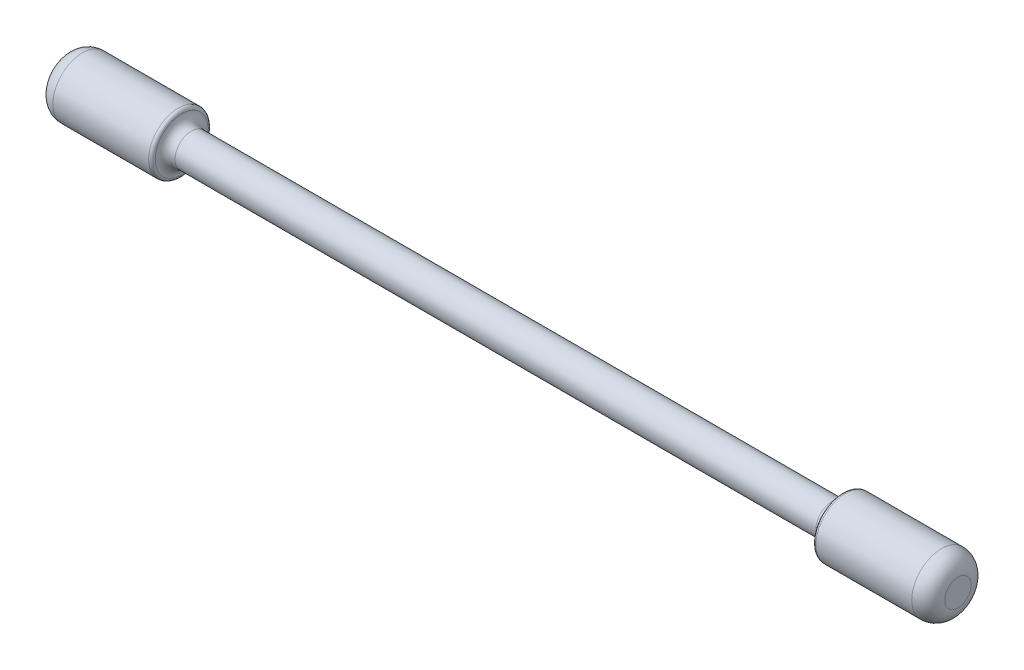
ISO-10303-21;
HEADER;
FILE_DESCRIPTION(('STEP AP214'),'2;1');
FILE_NAME('part.step','',(''),(''),'','','');
FILE_SCHEMA(('AUTOMOTIVE_DESIGN { 1 0 10303 214 1 1 1 1 }'));
ENDSEC;
DATA;
#1=APPLICATION_CONTEXT('core data for automotive mechanical design processes');
#2=APPLICATION_PROTOCOL_DEFINITION('international standard','automotive_design',2000,#1);
#3=PRODUCT_CONTEXT('',#1,'mechanical');
#4=PRODUCT('Part','Part','',(#3));
#5=PRODUCT_RELATED_PRODUCT_CATEGORY('part','',(#4));
#6=PRODUCT_DEFINITION_FORMATION('','',#4);
#7=PRODUCT_DEFINITION_CONTEXT('part definition',#1,'design');
#8=PRODUCT_DEFINITION('design','',#6,#7);
#9=PRODUCT_DEFINITION_SHAPE('','',#8);
#10=(LENGTH_UNIT() NAMED_UNIT(*) SI_UNIT(.MILLI.,.METRE.));
#11=(NAMED_UNIT(*) PLANE_ANGLE_UNIT() SI_UNIT($,.RADIAN.));
#12=(NAMED_UNIT(*) SI_UNIT($,.STERADIAN.) SOLID_ANGLE_UNIT());
#13=UNCERTAINTY_MEASURE_WITH_UNIT(LENGTH_MEASURE(1.E-05),#10,'distance_accuracy_value','');
#14=(GEOMETRIC_REPRESENTATION_CONTEXT(3) GLOBAL_UNCERTAINTY_ASSIGNED_CONTEXT((#13)) GLOBAL_UNIT_ASSIGNED_CONTEXT((#10,
#11,#12)) REPRESENTATION_CONTEXT('',''));
#15=CARTESIAN_POINT('',(0.,0.,0.));
#16=DIRECTION('',(0.,0.,1.));
#17=DIRECTION('',(1.,0.,0.));
#18=AXIS2_PLACEMENT_3D('',#15,#16,#17);
#19=CARTESIAN_POINT('',(-135.,0.,0.));
#20=DIRECTION('',(1.,0.,0.));
#21=DIRECTION('',(0.,0.,-1.));
#22=AXIS2_PLACEMENT_3D('',#19,#20,#21);
#23=PLANE('',#22);
#24=CARTESIAN_POINT('',(-135.,0.,0.));
#25=DIRECTION('',(1.,0.,0.));
#26=DIRECTION('',(0.,0.,-1.));
#27=AXIS2_PLACEMENT_3D('',#24,#25,#26);
#28=CIRCLE('',#27,4.00000000000003);
#29=CARTESIAN_POINT('',(-135.,0.,-4.00000000000003));
#30=VERTEX_POINT('',#29);
#31=EDGE_CURVE('E53',#30,#30,#28,.F.);
#32=ORIENTED_EDGE('',*,*,#31,.T.);
#33=EDGE_LOOP('',(#32));
#34=FACE_BOUND('',#33,.T.);
#35=ADVANCED_FACE('F40',(#34),#23,.F.);
#36=CARTESIAN_POINT('',(135.,0.,0.));
#37=DIRECTION('',(1.,0.,0.));
#38=DIRECTION('',(0.,0.,-1.));
#39=AXIS2_PLACEMENT_3D('',#36,#37,#38);
#40=CYLINDRICAL_SURFACE('',#39,9.00000000000003);
#41=CARTESIAN_POINT('',(-130.,0.,0.));
#42=DIRECTION('',(1.,0.,0.));
#43=DIRECTION('',(0.,0.,-1.));
#44=AXIS2_PLACEMENT_3D('',#41,#42,#43);
#45=CIRCLE('',#44,9.00000000000003);
#46=CARTESIAN_POINT('',(-130.,0.,-9.00000000000003));
#47=VERTEX_POINT('',#46);
#48=EDGE_CURVE('E58',#47,#47,#45,.T.);
#49=ORIENTED_EDGE('',*,*,#48,.T.);
#50=EDGE_LOOP('',(#49));
#51=FACE_BOUND('',#50,.T.);
#52=CARTESIAN_POINT('',(-101.,0.,0.));
#53=DIRECTION('',(-1.,0.,0.));
#54=DIRECTION('',(0.,0.,1.));
#55=AXIS2_PLACEMENT_3D('',#52,#53,#54);
#56=CIRCLE('',#55,9.00000000000003);
#57=CARTESIAN_POINT('',(-101.,0.,9.00000000000003));
#58=VERTEX_POINT('',#57);
#59=EDGE_CURVE('E64',#58,#58,#56,.T.);
#60=ORIENTED_EDGE('',*,*,#59,.T.);
#61=EDGE_LOOP('',(#60));
#62=FACE_BOUND('',#61,.T.);
#63=ADVANCED_FACE('F109',(#51,#62),#40,.T.);
#64=CARTESIAN_POINT('',(135.,0.,0.));
#65=DIRECTION('',(1.,0.,0.));
#66=DIRECTION('',(0.,0.,-1.));
#67=AXIS2_PLACEMENT_3D('',#64,#65,#66);
#68=CYLINDRICAL_SURFACE('',#67,5.00000000000003);
#69=CARTESIAN_POINT('',(97.,0.,0.));
#70=DIRECTION('',(1.,0.,0.));
#71=DIRECTION('',(0.,0.,-1.));
#72=AXIS2_PLACEMENT_3D('',#69,#70,#71);
#73=CIRCLE('',#72,5.00000000000003);
#74=CARTESIAN_POINT('',(97.,0.,-5.00000000000003));
#75=VERTEX_POINT('',#74);
#76=EDGE_CURVE('E76',#75,#75,#73,.F.);
#77=ORIENTED_EDGE('',*,*,#76,.T.);
#78=EDGE_LOOP('',(#77));
#79=FACE_BOUND('',#78,.T.);
#80=CARTESIAN_POINT('',(-97.,0.,0.));
#81=DIRECTION('',(-1.,0.,0.));
#82=DIRECTION('',(0.,0.,1.));
#83=AXIS2_PLACEMENT_3D('',#80,#81,#82);
#84=CIRCLE('',#83,5.00000000000003);
#85=CARTESIAN_POINT('',(-97.,0.,5.00000000000003));
#86=VERTEX_POINT('',#85);
#87=EDGE_CURVE('E80',#86,#86,#84,.F.);
#88=ORIENTED_EDGE('',*,*,#87,.T.);
#89=EDGE_LOOP('',(#88));
#90=FACE_BOUND('',#89,.T.);
#91=ADVANCED_FACE('F114',(#79,#90),#68,.T.);
#92=CARTESIAN_POINT('',(135.,0.,0.));
#93=DIRECTION('',(1.,0.,0.));
#94=DIRECTION('',(0.,0.,-1.));
#95=AXIS2_PLACEMENT_3D('',#92,#93,#94);
#96=CYLINDRICAL_SURFACE('',#95,8.99999999999995);
#97=CARTESIAN_POINT('',(130.,0.,0.));
#98=DIRECTION('',(-1.,0.,0.));
#99=DIRECTION('',(0.,0.,1.));
#100=AXIS2_PLACEMENT_3D('',#97,#98,#99);
#101=CIRCLE('',#100,8.99999999999995);
#102=CARTESIAN_POINT('',(130.,0.,8.99999999999995));
#103=VERTEX_POINT('',#102);
#104=EDGE_CURVE('E10',#103,#103,#101,.T.);
#105=ORIENTED_EDGE('',*,*,#104,.T.);
#106=EDGE_LOOP('',(#105));
#107=FACE_BOUND('',#106,.T.);
#108=CARTESIAN_POINT('',(101.,0.,0.));
#109=DIRECTION('',(1.,0.,0.));
#110=DIRECTION('',(0.,0.,-1.));
#111=AXIS2_PLACEMENT_3D('',#108,#109,#110);
#112=CIRCLE('',#111,8.99999999999995);
#113=CARTESIAN_POINT('',(101.,0.,-8.99999999999995));
#114=VERTEX_POINT('',#113);
#115=EDGE_CURVE('E68',#114,#114,#112,.T.);
#116=ORIENTED_EDGE('',*,*,#115,.T.);
#117=EDGE_LOOP('',(#116));
#118=FACE_BOUND('',#117,.T.);
#119=ADVANCED_FACE('F104',(#107,#118),#96,.T.);
#120=CARTESIAN_POINT('',(135.,0.,8.99999999999995));
#121=DIRECTION('',(-1.,0.,0.));
#122=DIRECTION('',(0.,0.,1.));
#123=AXIS2_PLACEMENT_3D('',#120,#121,#122);
#124=PLANE('',#123);
#125=CARTESIAN_POINT('',(135.,0.,0.));
#126=DIRECTION('',(-1.,0.,0.));
#127=DIRECTION('',(0.,0.,1.));
#128=AXIS2_PLACEMENT_3D('',#125,#126,#127);
#129=CIRCLE('',#128,3.99999999999995);
#130=CARTESIAN_POINT('',(135.,0.,3.99999999999995));
#131=VERTEX_POINT('',#130);
#132=EDGE_CURVE('E48',#131,#131,#129,.F.);
#133=ORIENTED_EDGE('',*,*,#132,.T.);
#134=EDGE_LOOP('',(#133));
#135=FACE_BOUND('',#134,.T.);
#136=ADVANCED_FACE('F95',(#135),#124,.F.);
#137=CARTESIAN_POINT('',(97.,0.,0.));
#138=DIRECTION('',(1.,0.,0.));
#139=DIRECTION('',(0.,0.,-1.));
#140=AXIS2_PLACEMENT_3D('',#137,#138,#139);
#141=TOROIDAL_SURFACE('',#140,8.00000000000003,3.);
#142=ORIENTED_EDGE('',*,*,#76,.F.);
#143=EDGE_LOOP('',(#142));
#144=FACE_BOUND('',#143,.T.);
#145=CARTESIAN_POINT('',(100.,0.,0.));
#146=DIRECTION('',(1.,0.,0.));
#147=DIRECTION('',(0.,0.,-1.));
#148=AXIS2_PLACEMENT_3D('',#145,#146,#147);
#149=CIRCLE('',#148,8.00000000000003);
#150=CARTESIAN_POINT('',(100.,0.,-8.00000000000003));
#151=VERTEX_POINT('',#150);
#152=EDGE_CURVE('E84',#151,#151,#149,.T.);
#153=ORIENTED_EDGE('',*,*,#152,.F.);
#154=EDGE_LOOP('',(#153));
#155=FACE_BOUND('',#154,.T.);
#156=ADVANCED_FACE('F92',(#144,#155),#141,.F.);
#157=CARTESIAN_POINT('',(-97.,0.,0.));
#158=DIRECTION('',(-1.,0.,0.));
#159=DIRECTION('',(0.,0.,1.));
#160=AXIS2_PLACEMENT_3D('',#157,#158,#159);
#161=TOROIDAL_SURFACE('',#160,8.00000000000003,3.);
#162=CARTESIAN_POINT('',(-100.,0.,0.));
#163=DIRECTION('',(-1.,0.,0.));
#164=DIRECTION('',(0.,0.,1.));
#165=AXIS2_PLACEMENT_3D('',#162,#163,#164);
#166=CIRCLE('',#165,8.00000000000003);
#167=CARTESIAN_POINT('',(-100.,0.,8.00000000000003));
#168=VERTEX_POINT('',#167);
#169=EDGE_CURVE('E72',#168,#168,#166,.T.);
#170=ORIENTED_EDGE('',*,*,#169,.F.);
#171=EDGE_LOOP('',(#170));
#172=FACE_BOUND('',#171,.T.);
#173=ORIENTED_EDGE('',*,*,#87,.F.);
#174=EDGE_LOOP('',(#173));
#175=FACE_BOUND('',#174,.T.);
#176=ADVANCED_FACE('F94',(#172,#175),#161,.F.);
#177=CARTESIAN_POINT('',(101.,0.,0.));
#178=DIRECTION('',(1.,0.,0.));
#179=DIRECTION('',(0.,0.,-1.));
#180=AXIS2_PLACEMENT_3D('',#177,#178,#179);
#181=TOROIDAL_SURFACE('',#180,7.99999999999995,1.);
#182=ORIENTED_EDGE('',*,*,#152,.T.);
#183=EDGE_LOOP('',(#182));
#184=FACE_BOUND('',#183,.T.);
#185=ORIENTED_EDGE('',*,*,#115,.F.);
#186=EDGE_LOOP('',(#185));
#187=FACE_BOUND('',#186,.T.);
#188=ADVANCED_FACE('F89',(#184,#187),#181,.T.);
#189=CARTESIAN_POINT('',(-101.,0.,0.));
#190=DIRECTION('',(-1.,0.,0.));
#191=DIRECTION('',(0.,0.,1.));
#192=AXIS2_PLACEMENT_3D('',#189,#190,#191);
#193=TOROIDAL_SURFACE('',#192,8.00000000000003,1.);
#194=ORIENTED_EDGE('',*,*,#59,.F.);
#195=EDGE_LOOP('',(#194));
#196=FACE_BOUND('',#195,.T.);
#197=ORIENTED_EDGE('',*,*,#169,.T.);
#198=EDGE_LOOP('',(#197));
#199=FACE_BOUND('',#198,.T.);
#200=ADVANCED_FACE('F127',(#196,#199),#193,.T.);
#201=CARTESIAN_POINT('',(-130.,0.,0.));
#202=DIRECTION('',(1.,0.,0.));
#203=DIRECTION('',(0.,0.,-1.));
#204=AXIS2_PLACEMENT_3D('',#201,#202,#203);
#205=DEGENERATE_TOROIDAL_SURFACE('',#204,4.00000000000003,5.,.T.);
#206=ORIENTED_EDGE('',*,*,#31,.F.);
#207=EDGE_LOOP('',(#206));
#208=FACE_BOUND('',#207,.T.);
#209=ORIENTED_EDGE('',*,*,#48,.F.);
#210=EDGE_LOOP('',(#209));
#211=FACE_BOUND('',#210,.T.);
#212=ADVANCED_FACE('F132',(#208,#211),#205,.T.);
#213=CARTESIAN_POINT('',(130.,0.,0.));
#214=DIRECTION('',(-1.,0.,0.));
#215=DIRECTION('',(0.,0.,1.));
#216=AXIS2_PLACEMENT_3D('',#213,#214,#215);
#217=DEGENERATE_TOROIDAL_SURFACE('',#216,3.99999999999995,5.,.T.);
#218=ORIENTED_EDGE('',*,*,#104,.F.);
#219=EDGE_LOOP('',(#218));
#220=FACE_BOUND('',#219,.T.);
#221=ORIENTED_EDGE('',*,*,#132,.F.);
#222=EDGE_LOOP('',(#221));
#223=FACE_BOUND('',#222,.T.);
#224=ADVANCED_FACE('F42',(#220,#223),#217,.T.);
#225=CLOSED_SHELL('',(#35,#63,#91,#119,#136,#156,#176,#188,#200,#212,#224));
#226=MANIFOLD_SOLID_BREP('B2',#225);
#227=ADVANCED_BREP_SHAPE_REPRESENTATION('',(#18,#226),#14);
#228=SHAPE_DEFINITION_REPRESENTATION(#9,#227);
ENDSEC;
END-ISO-10303-21;
